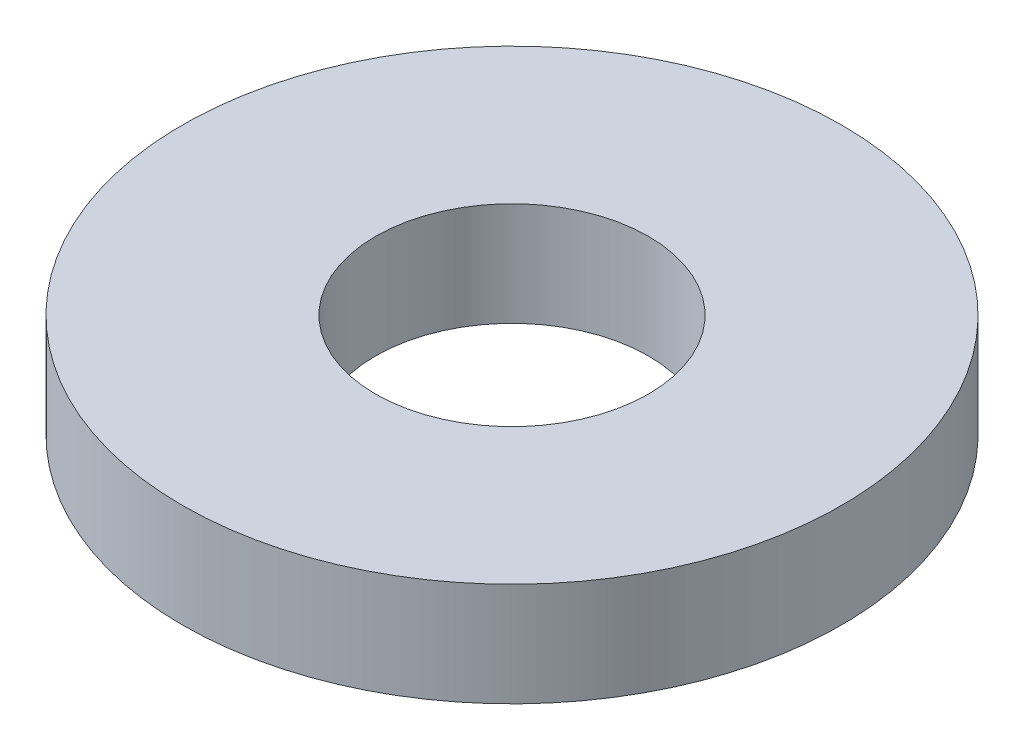
ISO-10303-21;
HEADER;
FILE_DESCRIPTION(('STEP AP214'),'2;1');
FILE_NAME('part.step','',(''),(''),'','','');
FILE_SCHEMA(('AUTOMOTIVE_DESIGN { 1 0 10303 214 1 1 1 1 }'));
ENDSEC;
DATA;
#1=APPLICATION_CONTEXT('core data for automotive mechanical design processes');
#2=APPLICATION_PROTOCOL_DEFINITION('international standard','automotive_design',2000,#1);
#3=PRODUCT_CONTEXT('',#1,'mechanical');
#4=PRODUCT('Part','Part','',(#3));
#5=PRODUCT_RELATED_PRODUCT_CATEGORY('part','',(#4));
#6=PRODUCT_DEFINITION_FORMATION('','',#4);
#7=PRODUCT_DEFINITION_CONTEXT('part definition',#1,'design');
#8=PRODUCT_DEFINITION('design','',#6,#7);
#9=PRODUCT_DEFINITION_SHAPE('','',#8);
#10=(LENGTH_UNIT() NAMED_UNIT(*) SI_UNIT(.MILLI.,.METRE.));
#11=(NAMED_UNIT(*) PLANE_ANGLE_UNIT() SI_UNIT($,.RADIAN.));
#12=(NAMED_UNIT(*) SI_UNIT($,.STERADIAN.) SOLID_ANGLE_UNIT());
#13=UNCERTAINTY_MEASURE_WITH_UNIT(LENGTH_MEASURE(1.E-05),#10,'distance_accuracy_value','');
#14=(GEOMETRIC_REPRESENTATION_CONTEXT(3) GLOBAL_UNCERTAINTY_ASSIGNED_CONTEXT((#13)) GLOBAL_UNIT_ASSIGNED_CONTEXT((#10,
#11,#12)) REPRESENTATION_CONTEXT('',''));
#15=CARTESIAN_POINT('',(0.,0.,0.));
#16=DIRECTION('',(0.,0.,1.));
#17=DIRECTION('',(1.,0.,0.));
#18=AXIS2_PLACEMENT_3D('',#15,#16,#17);
#19=CARTESIAN_POINT('',(0.,1.1,0.));
#20=DIRECTION('',(0.,1.,0.));
#21=DIRECTION('',(0.,0.,1.));
#22=AXIS2_PLACEMENT_3D('',#19,#20,#21);
#23=PLANE('',#22);
#24=CARTESIAN_POINT('',(0.,1.1,0.));
#25=DIRECTION('',(0.,1.,0.));
#26=DIRECTION('',(0.,0.,1.));
#27=AXIS2_PLACEMENT_3D('',#24,#25,#26);
#28=CIRCLE('',#27,3.5);
#29=CARTESIAN_POINT('',(0.,1.1,3.5));
#30=VERTEX_POINT('',#29);
#31=EDGE_CURVE('E10',#30,#30,#28,.T.);
#32=ORIENTED_EDGE('',*,*,#31,.T.);
#33=EDGE_LOOP('',(#32));
#34=FACE_BOUND('',#33,.T.);
#35=CARTESIAN_POINT('',(0.,1.1,0.));
#36=DIRECTION('',(0.,1.,0.));
#37=DIRECTION('',(0.,0.,1.));
#38=AXIS2_PLACEMENT_3D('',#35,#36,#37);
#39=CIRCLE('',#38,1.45);
#40=CARTESIAN_POINT('',(0.,1.1,1.45));
#41=VERTEX_POINT('',#40);
#42=EDGE_CURVE('E56',#41,#41,#39,.T.);
#43=ORIENTED_EDGE('',*,*,#42,.F.);
#44=EDGE_LOOP('',(#43));
#45=FACE_BOUND('',#44,.T.);
#46=ADVANCED_FACE('F43',(#34,#45),#23,.T.);
#47=CARTESIAN_POINT('',(0.,0.,0.));
#48=DIRECTION('',(0.,1.,0.));
#49=DIRECTION('',(0.,0.,1.));
#50=AXIS2_PLACEMENT_3D('',#47,#48,#49);
#51=PLANE('',#50);
#52=CARTESIAN_POINT('',(0.,0.,0.));
#53=DIRECTION('',(0.,1.,0.));
#54=DIRECTION('',(0.,0.,1.));
#55=AXIS2_PLACEMENT_3D('',#52,#53,#54);
#56=CIRCLE('',#55,3.5);
#57=CARTESIAN_POINT('',(0.,0.,3.5));
#58=VERTEX_POINT('',#57);
#59=EDGE_CURVE('E47',#58,#58,#56,.T.);
#60=ORIENTED_EDGE('',*,*,#59,.F.);
#61=EDGE_LOOP('',(#60));
#62=FACE_BOUND('',#61,.T.);
#63=CARTESIAN_POINT('',(0.,0.,0.));
#64=DIRECTION('',(0.,1.,0.));
#65=DIRECTION('',(0.,0.,1.));
#66=AXIS2_PLACEMENT_3D('',#63,#64,#65);
#67=CIRCLE('',#66,1.45);
#68=CARTESIAN_POINT('',(0.,0.,1.45));
#69=VERTEX_POINT('',#68);
#70=EDGE_CURVE('E58',#69,#69,#67,.T.);
#71=ORIENTED_EDGE('',*,*,#70,.T.);
#72=EDGE_LOOP('',(#71));
#73=FACE_BOUND('',#72,.T.);
#74=ADVANCED_FACE('F70',(#62,#73),#51,.F.);
#75=CARTESIAN_POINT('',(0.,1.1,0.));
#76=DIRECTION('',(0.,-1.,0.));
#77=DIRECTION('',(0.,0.,-1.));
#78=AXIS2_PLACEMENT_3D('',#75,#76,#77);
#79=CYLINDRICAL_SURFACE('',#78,3.5);
#80=ORIENTED_EDGE('',*,*,#31,.F.);
#81=EDGE_LOOP('',(#80));
#82=FACE_BOUND('',#81,.T.);
#83=ORIENTED_EDGE('',*,*,#59,.T.);
#84=EDGE_LOOP('',(#83));
#85=FACE_BOUND('',#84,.T.);
#86=ADVANCED_FACE('F45',(#82,#85),#79,.T.);
#87=CARTESIAN_POINT('',(0.,1.1,0.));
#88=DIRECTION('',(0.,-1.,0.));
#89=DIRECTION('',(0.,0.,-1.));
#90=AXIS2_PLACEMENT_3D('',#87,#88,#89);
#91=CYLINDRICAL_SURFACE('',#90,1.45);
#92=ORIENTED_EDGE('',*,*,#42,.T.);
#93=EDGE_LOOP('',(#92));
#94=FACE_BOUND('',#93,.T.);
#95=ORIENTED_EDGE('',*,*,#70,.F.);
#96=EDGE_LOOP('',(#95));
#97=FACE_BOUND('',#96,.T.);
#98=ADVANCED_FACE('F66',(#94,#97),#91,.F.);
#99=CLOSED_SHELL('',(#46,#74,#86,#98));
#100=MANIFOLD_SOLID_BREP('B2',#99);
#101=ADVANCED_BREP_SHAPE_REPRESENTATION('',(#18,#100),#14);
#102=SHAPE_DEFINITION_REPRESENTATION(#9,#101);
ENDSEC;
END-ISO-10303-21;
